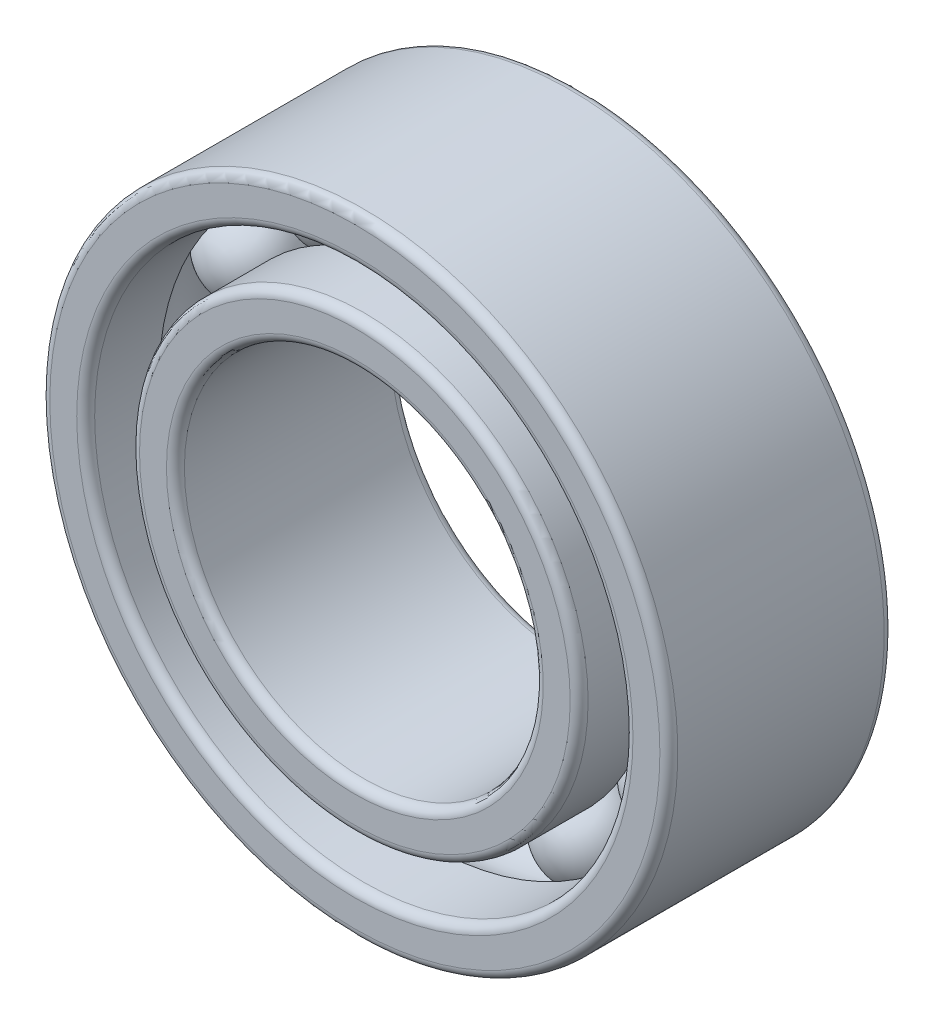
ISO-10303-21;
HEADER;
FILE_DESCRIPTION(('STEP AP214'),'2;1');
FILE_NAME('part.step','',(''),(''),'','','');
FILE_SCHEMA(('AUTOMOTIVE_DESIGN { 1 0 10303 214 1 1 1 1 }'));
ENDSEC;
DATA;
#1=APPLICATION_CONTEXT('core data for automotive mechanical design processes');
#2=APPLICATION_PROTOCOL_DEFINITION('international standard','automotive_design',2000,#1);
#3=PRODUCT_CONTEXT('',#1,'mechanical');
#4=PRODUCT('Part','Part','',(#3));
#5=PRODUCT_RELATED_PRODUCT_CATEGORY('part','',(#4));
#6=PRODUCT_DEFINITION_FORMATION('','',#4);
#7=PRODUCT_DEFINITION_CONTEXT('part definition',#1,'design');
#8=PRODUCT_DEFINITION('design','',#6,#7);
#9=PRODUCT_DEFINITION_SHAPE('','',#8);
#10=(LENGTH_UNIT() NAMED_UNIT(*) SI_UNIT(.MILLI.,.METRE.));
#11=(NAMED_UNIT(*) PLANE_ANGLE_UNIT() SI_UNIT($,.RADIAN.));
#12=(NAMED_UNIT(*) SI_UNIT($,.STERADIAN.) SOLID_ANGLE_UNIT());
#13=UNCERTAINTY_MEASURE_WITH_UNIT(LENGTH_MEASURE(1.E-05),#10,'distance_accuracy_value','');
#14=(GEOMETRIC_REPRESENTATION_CONTEXT(3) GLOBAL_UNCERTAINTY_ASSIGNED_CONTEXT((#13)) GLOBAL_UNIT_ASSIGNED_CONTEXT((#10,
#11,#12)) REPRESENTATION_CONTEXT('',''));
#15=CARTESIAN_POINT('',(0.,0.,0.));
#16=DIRECTION('',(0.,0.,1.));
#17=DIRECTION('',(1.,0.,0.));
#18=AXIS2_PLACEMENT_3D('',#15,#16,#17);
#19=CARTESIAN_POINT('',(1.37499999999997,2.38156986040722,0.));
#20=DIRECTION('',(0.,0.,1.));
#21=DIRECTION('',(0.499999999999989,0.866025403784445,0.));
#22=AXIS2_PLACEMENT_3D('',#19,#20,#21);
#23=SPHERICAL_SURFACE('',#22,0.5);
#24=CARTESIAN_POINT('',(1.37499999999997,2.38156986040722,0.5));
#25=VERTEX_POINT('',#24);
#26=VERTEX_LOOP('',#25);
#27=FACE_BOUND('',#26,.T.);
#28=ADVANCED_FACE('F38',(#27),#23,.T.);
#29=CLOSED_SHELL('',(#28));
#30=MANIFOLD_SOLID_BREP('B2',#29);
#31=CARTESIAN_POINT('',(2.38156986040719,1.37500000000003,0.));
#32=DIRECTION('',(0.,0.,1.));
#33=DIRECTION('',(0.866025403784433,0.50000000000001,0.));
#34=AXIS2_PLACEMENT_3D('',#31,#32,#33);
#35=SPHERICAL_SURFACE('',#34,0.5);
#36=CARTESIAN_POINT('',(2.38156986040719,1.37500000000003,0.5));
#37=VERTEX_POINT('',#36);
#38=VERTEX_LOOP('',#37);
#39=FACE_BOUND('',#38,.T.);
#40=ADVANCED_FACE('F57',(#39),#35,.T.);
#41=CLOSED_SHELL('',(#40));
#42=MANIFOLD_SOLID_BREP('B6',#41);
#43=CARTESIAN_POINT('',(2.75,0.,0.));
#44=DIRECTION('',(0.,0.,1.));
#45=DIRECTION('',(1.,0.,0.));
#46=AXIS2_PLACEMENT_3D('',#43,#44,#45);
#47=SPHERICAL_SURFACE('',#46,0.5);
#48=CARTESIAN_POINT('',(2.75,0.,0.5));
#49=VERTEX_POINT('',#48);
#50=VERTEX_LOOP('',#49);
#51=FACE_BOUND('',#50,.T.);
#52=ADVANCED_FACE('F76',(#51),#47,.T.);
#53=CLOSED_SHELL('',(#52));
#54=MANIFOLD_SOLID_BREP('B34',#53);
#55=CARTESIAN_POINT('',(2.38156986040722,-1.37499999999998,0.));
#56=DIRECTION('',(0.,0.,1.));
#57=DIRECTION('',(0.866025403784443,-0.499999999999992,0.));
#58=AXIS2_PLACEMENT_3D('',#55,#56,#57);
#59=SPHERICAL_SURFACE('',#58,0.5);
#60=CARTESIAN_POINT('',(2.38156986040722,-1.37499999999998,0.5));
#61=VERTEX_POINT('',#60);
#62=VERTEX_LOOP('',#61);
#63=FACE_BOUND('',#62,.T.);
#64=ADVANCED_FACE('F95',(#63),#59,.T.);
#65=CLOSED_SHELL('',(#64));
#66=MANIFOLD_SOLID_BREP('B53',#65);
#67=CARTESIAN_POINT('',(1.37500000000002,-2.38156986040719,0.));
#68=DIRECTION('',(0.,0.,1.));
#69=DIRECTION('',(0.500000000000007,-0.866025403784435,0.));
#70=AXIS2_PLACEMENT_3D('',#67,#68,#69);
#71=SPHERICAL_SURFACE('',#70,0.5);
#72=CARTESIAN_POINT('',(1.37500000000002,-2.38156986040719,0.5));
#73=VERTEX_POINT('',#72);
#74=VERTEX_LOOP('',#73);
#75=FACE_BOUND('',#74,.T.);
#76=ADVANCED_FACE('F114',(#75),#71,.T.);
#77=CLOSED_SHELL('',(#76));
#78=MANIFOLD_SOLID_BREP('B72',#77);
#79=CARTESIAN_POINT('',(0.,-2.75,0.));
#80=DIRECTION('',(0.,0.,1.));
#81=DIRECTION('',(0.,-1.,0.));
#82=AXIS2_PLACEMENT_3D('',#79,#80,#81);
#83=SPHERICAL_SURFACE('',#82,0.5);
#84=CARTESIAN_POINT('',(0.,-2.75,0.5));
#85=VERTEX_POINT('',#84);
#86=VERTEX_LOOP('',#85);
#87=FACE_BOUND('',#86,.T.);
#88=ADVANCED_FACE('F133',(#87),#83,.T.);
#89=CLOSED_SHELL('',(#88));
#90=MANIFOLD_SOLID_BREP('B91',#89);
#91=CARTESIAN_POINT('',(-1.37499999999999,-2.38156986040721,0.));
#92=DIRECTION('',(0.,0.,1.));
#93=DIRECTION('',(-0.499999999999995,-0.866025403784442,0.));
#94=AXIS2_PLACEMENT_3D('',#91,#92,#93);
#95=SPHERICAL_SURFACE('',#94,0.5);
#96=CARTESIAN_POINT('',(-1.37499999999999,-2.38156986040721,0.5));
#97=VERTEX_POINT('',#96);
#98=VERTEX_LOOP('',#97);
#99=FACE_BOUND('',#98,.T.);
#100=ADVANCED_FACE('F152',(#99),#95,.T.);
#101=CLOSED_SHELL('',(#100));
#102=MANIFOLD_SOLID_BREP('B110',#101);
#103=CARTESIAN_POINT('',(-2.3815698604072,-1.37500000000001,0.));
#104=DIRECTION('',(0.,0.,1.));
#105=DIRECTION('',(-0.866025403784436,-0.500000000000004,0.));
#106=AXIS2_PLACEMENT_3D('',#103,#104,#105);
#107=SPHERICAL_SURFACE('',#106,0.5);
#108=CARTESIAN_POINT('',(-2.3815698604072,-1.37500000000001,0.5));
#109=VERTEX_POINT('',#108);
#110=VERTEX_LOOP('',#109);
#111=FACE_BOUND('',#110,.T.);
#112=ADVANCED_FACE('F171',(#111),#107,.T.);
#113=CLOSED_SHELL('',(#112));
#114=MANIFOLD_SOLID_BREP('B129',#113);
#115=CARTESIAN_POINT('',(-2.75,0.,0.));
#116=DIRECTION('',(0.,0.,1.));
#117=DIRECTION('',(-1.,0.,0.));
#118=AXIS2_PLACEMENT_3D('',#115,#116,#117);
#119=SPHERICAL_SURFACE('',#118,0.5);
#120=CARTESIAN_POINT('',(-2.75,0.,0.5));
#121=VERTEX_POINT('',#120);
#122=VERTEX_LOOP('',#121);
#123=FACE_BOUND('',#122,.T.);
#124=ADVANCED_FACE('F190',(#123),#119,.T.);
#125=CLOSED_SHELL('',(#124));
#126=MANIFOLD_SOLID_BREP('B148',#125);
#127=CARTESIAN_POINT('',(-2.38156986040721,1.37499999999999,0.));
#128=DIRECTION('',(0.,0.,1.));
#129=DIRECTION('',(-0.86602540378444,0.499999999999998,0.));
#130=AXIS2_PLACEMENT_3D('',#127,#128,#129);
#131=SPHERICAL_SURFACE('',#130,0.5);
#132=CARTESIAN_POINT('',(-2.38156986040721,1.37499999999999,0.5));
#133=VERTEX_POINT('',#132);
#134=VERTEX_LOOP('',#133);
#135=FACE_BOUND('',#134,.T.);
#136=ADVANCED_FACE('F209',(#135),#131,.T.);
#137=CLOSED_SHELL('',(#136));
#138=MANIFOLD_SOLID_BREP('B167',#137);
#139=CARTESIAN_POINT('',(-1.375,2.3815698604072,0.));
#140=DIRECTION('',(0.,0.,1.));
#141=DIRECTION('',(-0.500000000000001,0.866025403784438,0.));
#142=AXIS2_PLACEMENT_3D('',#139,#140,#141);
#143=SPHERICAL_SURFACE('',#142,0.5);
#144=CARTESIAN_POINT('',(-1.375,2.3815698604072,0.5));
#145=VERTEX_POINT('',#144);
#146=VERTEX_LOOP('',#145);
#147=FACE_BOUND('',#146,.T.);
#148=ADVANCED_FACE('F228',(#147),#143,.T.);
#149=CLOSED_SHELL('',(#148));
#150=MANIFOLD_SOLID_BREP('B186',#149);
#151=CARTESIAN_POINT('',(0.,2.75,0.));
#152=DIRECTION('',(0.,0.,1.));
#153=DIRECTION('',(0.,1.,0.));
#154=AXIS2_PLACEMENT_3D('',#151,#152,#153);
#155=SPHERICAL_SURFACE('',#154,0.5);
#156=CARTESIAN_POINT('',(0.,2.75,0.5));
#157=VERTEX_POINT('',#156);
#158=VERTEX_LOOP('',#157);
#159=FACE_BOUND('',#158,.T.);
#160=ADVANCED_FACE('F249',(#159),#155,.T.);
#161=CLOSED_SHELL('',(#160));
#162=MANIFOLD_SOLID_BREP('B205',#161);
#163=CARTESIAN_POINT('',(0.,0.,0.));
#164=DIRECTION('',(0.,0.,1.));
#165=DIRECTION('',(1.,0.,0.));
#166=AXIS2_PLACEMENT_3D('',#163,#164,#165);
#167=TOROIDAL_SURFACE('',#166,2.75,0.5);
#168=CARTESIAN_POINT('',(0.,0.,-0.433012701892219));
#169=DIRECTION('',(0.,0.,1.));
#170=DIRECTION('',(1.,0.,0.));
#171=AXIS2_PLACEMENT_3D('',#168,#169,#170);
#172=CIRCLE('',#171,2.5);
#173=CARTESIAN_POINT('',(2.5,0.,-0.433012701892219));
#174=VERTEX_POINT('',#173);
#175=EDGE_CURVE('E304',#174,#174,#172,.T.);
#176=ORIENTED_EDGE('',*,*,#175,.T.);
#177=EDGE_LOOP('',(#176));
#178=FACE_BOUND('',#177,.T.);
#179=CARTESIAN_POINT('',(0.,0.,0.433012701892219));
#180=DIRECTION('',(0.,0.,1.));
#181=DIRECTION('',(1.,0.,0.));
#182=AXIS2_PLACEMENT_3D('',#179,#180,#181);
#183=CIRCLE('',#182,2.5);
#184=CARTESIAN_POINT('',(2.5,0.,0.433012701892219));
#185=VERTEX_POINT('',#184);
#186=EDGE_CURVE('E301',#185,#185,#183,.T.);
#187=ORIENTED_EDGE('',*,*,#186,.F.);
#188=EDGE_LOOP('',(#187));
#189=FACE_BOUND('',#188,.T.);
#190=ADVANCED_FACE('F269',(#178,#189),#167,.F.);
#191=CARTESIAN_POINT('',(0.,0.,0.));
#192=DIRECTION('',(0.,0.,1.));
#193=DIRECTION('',(1.,0.,0.));
#194=AXIS2_PLACEMENT_3D('',#191,#192,#193);
#195=CYLINDRICAL_SURFACE('',#194,2.5);
#196=CARTESIAN_POINT('',(0.,0.,1.15));
#197=DIRECTION('',(0.,0.,-1.));
#198=DIRECTION('',(-1.,0.,0.));
#199=AXIS2_PLACEMENT_3D('',#196,#197,#198);
#200=CIRCLE('',#199,2.5);
#201=CARTESIAN_POINT('',(-2.5,0.,1.15));
#202=VERTEX_POINT('',#201);
#203=EDGE_CURVE('E248',#202,#202,#200,.T.);
#204=ORIENTED_EDGE('',*,*,#203,.T.);
#205=EDGE_LOOP('',(#204));
#206=FACE_BOUND('',#205,.T.);
#207=ORIENTED_EDGE('',*,*,#186,.T.);
#208=EDGE_LOOP('',(#207));
#209=FACE_BOUND('',#208,.T.);
#210=ADVANCED_FACE('F327',(#206,#209),#195,.T.);
#211=CARTESIAN_POINT('',(0.,0.,1.25));
#212=DIRECTION('',(0.,0.,-1.));
#213=DIRECTION('',(-1.,0.,0.));
#214=AXIS2_PLACEMENT_3D('',#211,#212,#213);
#215=PLANE('',#214);
#216=CARTESIAN_POINT('',(0.,0.,1.25));
#217=DIRECTION('',(0.,0.,-1.));
#218=DIRECTION('',(-1.,0.,0.));
#219=AXIS2_PLACEMENT_3D('',#216,#217,#218);
#220=CIRCLE('',#219,2.4);
#221=CARTESIAN_POINT('',(-2.4,0.,1.25));
#222=VERTEX_POINT('',#221);
#223=EDGE_CURVE('E276',#222,#222,#220,.F.);
#224=ORIENTED_EDGE('',*,*,#223,.T.);
#225=EDGE_LOOP('',(#224));
#226=FACE_BOUND('',#225,.T.);
#227=CARTESIAN_POINT('',(0.,0.,1.25));
#228=DIRECTION('',(0.,0.,-1.));
#229=DIRECTION('',(-1.,0.,0.));
#230=AXIS2_PLACEMENT_3D('',#227,#228,#229);
#231=CIRCLE('',#230,2.1);
#232=CARTESIAN_POINT('',(-2.1,0.,1.25));
#233=VERTEX_POINT('',#232);
#234=EDGE_CURVE('E280',#233,#233,#231,.T.);
#235=ORIENTED_EDGE('',*,*,#234,.T.);
#236=EDGE_LOOP('',(#235));
#237=FACE_BOUND('',#236,.T.);
#238=ADVANCED_FACE('F332',(#226,#237),#215,.F.);
#239=CARTESIAN_POINT('',(0.,0.,0.));
#240=DIRECTION('',(0.,0.,1.));
#241=DIRECTION('',(1.,0.,0.));
#242=AXIS2_PLACEMENT_3D('',#239,#240,#241);
#243=CYLINDRICAL_SURFACE('',#242,2.);
#244=CARTESIAN_POINT('',(0.,0.,-1.15));
#245=DIRECTION('',(0.,0.,-1.));
#246=DIRECTION('',(-1.,0.,0.));
#247=AXIS2_PLACEMENT_3D('',#244,#245,#246);
#248=CIRCLE('',#247,2.);
#249=CARTESIAN_POINT('',(-2.,0.,-1.15));
#250=VERTEX_POINT('',#249);
#251=EDGE_CURVE('E284',#250,#250,#248,.T.);
#252=ORIENTED_EDGE('',*,*,#251,.T.);
#253=EDGE_LOOP('',(#252));
#254=FACE_BOUND('',#253,.T.);
#255=CARTESIAN_POINT('',(0.,0.,1.15));
#256=DIRECTION('',(0.,0.,-1.));
#257=DIRECTION('',(-1.,0.,0.));
#258=AXIS2_PLACEMENT_3D('',#255,#256,#257);
#259=CIRCLE('',#258,2.);
#260=CARTESIAN_POINT('',(-2.,0.,1.15));
#261=VERTEX_POINT('',#260);
#262=EDGE_CURVE('E289',#261,#261,#259,.F.);
#263=ORIENTED_EDGE('',*,*,#262,.T.);
#264=EDGE_LOOP('',(#263));
#265=FACE_BOUND('',#264,.T.);
#266=ADVANCED_FACE('F323',(#254,#265),#243,.F.);
#267=CARTESIAN_POINT('',(0.,0.,-1.25));
#268=DIRECTION('',(0.,0.,-1.));
#269=DIRECTION('',(-1.,0.,0.));
#270=AXIS2_PLACEMENT_3D('',#267,#268,#269);
#271=PLANE('',#270);
#272=CARTESIAN_POINT('',(0.,0.,-1.25));
#273=DIRECTION('',(0.,0.,-1.));
#274=DIRECTION('',(-1.,0.,0.));
#275=AXIS2_PLACEMENT_3D('',#272,#273,#274);
#276=CIRCLE('',#275,2.4);
#277=CARTESIAN_POINT('',(-2.4,0.,-1.25));
#278=VERTEX_POINT('',#277);
#279=EDGE_CURVE('E292',#278,#278,#276,.T.);
#280=ORIENTED_EDGE('',*,*,#279,.T.);
#281=EDGE_LOOP('',(#280));
#282=FACE_BOUND('',#281,.T.);
#283=CARTESIAN_POINT('',(0.,0.,-1.25));
#284=DIRECTION('',(0.,0.,-1.));
#285=DIRECTION('',(-1.,0.,0.));
#286=AXIS2_PLACEMENT_3D('',#283,#284,#285);
#287=CIRCLE('',#286,2.1);
#288=CARTESIAN_POINT('',(-2.1,0.,-1.25));
#289=VERTEX_POINT('',#288);
#290=EDGE_CURVE('E295',#289,#289,#287,.F.);
#291=ORIENTED_EDGE('',*,*,#290,.T.);
#292=EDGE_LOOP('',(#291));
#293=FACE_BOUND('',#292,.T.);
#294=ADVANCED_FACE('F313',(#282,#293),#271,.T.);
#295=CARTESIAN_POINT('',(0.,0.,0.));
#296=DIRECTION('',(0.,0.,1.));
#297=DIRECTION('',(1.,0.,0.));
#298=AXIS2_PLACEMENT_3D('',#295,#296,#297);
#299=CYLINDRICAL_SURFACE('',#298,2.5);
#300=CARTESIAN_POINT('',(0.,0.,-1.15));
#301=DIRECTION('',(0.,0.,-1.));
#302=DIRECTION('',(-1.,0.,0.));
#303=AXIS2_PLACEMENT_3D('',#300,#301,#302);
#304=CIRCLE('',#303,2.5);
#305=CARTESIAN_POINT('',(-2.5,0.,-1.15));
#306=VERTEX_POINT('',#305);
#307=EDGE_CURVE('E298',#306,#306,#304,.F.);
#308=ORIENTED_EDGE('',*,*,#307,.T.);
#309=EDGE_LOOP('',(#308));
#310=FACE_BOUND('',#309,.T.);
#311=ORIENTED_EDGE('',*,*,#175,.F.);
#312=EDGE_LOOP('',(#311));
#313=FACE_BOUND('',#312,.T.);
#314=ADVANCED_FACE('F310',(#310,#313),#299,.T.);
#315=CARTESIAN_POINT('',(0.,0.,-1.15));
#316=DIRECTION('',(0.,0.,-1.));
#317=DIRECTION('',(-1.,0.,0.));
#318=AXIS2_PLACEMENT_3D('',#315,#316,#317);
#319=TOROIDAL_SURFACE('',#318,2.4,0.1);
#320=ORIENTED_EDGE('',*,*,#279,.F.);
#321=EDGE_LOOP('',(#320));
#322=FACE_BOUND('',#321,.T.);
#323=ORIENTED_EDGE('',*,*,#307,.F.);
#324=EDGE_LOOP('',(#323));
#325=FACE_BOUND('',#324,.T.);
#326=ADVANCED_FACE('F312',(#322,#325),#319,.T.);
#327=CARTESIAN_POINT('',(0.,0.,-1.15));
#328=DIRECTION('',(0.,0.,-1.));
#329=DIRECTION('',(-1.,0.,0.));
#330=AXIS2_PLACEMENT_3D('',#327,#328,#329);
#331=TOROIDAL_SURFACE('',#330,2.1,0.1);
#332=ORIENTED_EDGE('',*,*,#251,.F.);
#333=EDGE_LOOP('',(#332));
#334=FACE_BOUND('',#333,.T.);
#335=ORIENTED_EDGE('',*,*,#290,.F.);
#336=EDGE_LOOP('',(#335));
#337=FACE_BOUND('',#336,.T.);
#338=ADVANCED_FACE('F320',(#334,#337),#331,.T.);
#339=CARTESIAN_POINT('',(0.,0.,1.15));
#340=DIRECTION('',(0.,0.,-1.));
#341=DIRECTION('',(-1.,0.,0.));
#342=AXIS2_PLACEMENT_3D('',#339,#340,#341);
#343=TOROIDAL_SURFACE('',#342,2.4,0.1);
#344=ORIENTED_EDGE('',*,*,#203,.F.);
#345=EDGE_LOOP('',(#344));
#346=FACE_BOUND('',#345,.T.);
#347=ORIENTED_EDGE('',*,*,#223,.F.);
#348=EDGE_LOOP('',(#347));
#349=FACE_BOUND('',#348,.T.);
#350=ADVANCED_FACE('F337',(#346,#349),#343,.T.);
#351=CARTESIAN_POINT('',(0.,0.,1.15));
#352=DIRECTION('',(0.,0.,-1.));
#353=DIRECTION('',(-1.,0.,0.));
#354=AXIS2_PLACEMENT_3D('',#351,#352,#353);
#355=TOROIDAL_SURFACE('',#354,2.1,0.1);
#356=ORIENTED_EDGE('',*,*,#234,.F.);
#357=EDGE_LOOP('',(#356));
#358=FACE_BOUND('',#357,.T.);
#359=ORIENTED_EDGE('',*,*,#262,.F.);
#360=EDGE_LOOP('',(#359));
#361=FACE_BOUND('',#360,.T.);
#362=ADVANCED_FACE('F271',(#358,#361),#355,.T.);
#363=CLOSED_SHELL('',(#190,#210,#238,#266,#294,#314,#326,#338,#350,#362));
#364=MANIFOLD_SOLID_BREP('B224',#363);
#365=CARTESIAN_POINT('',(0.,0.,0.));
#366=DIRECTION('',(0.,0.,1.));
#367=DIRECTION('',(1.,0.,0.));
#368=AXIS2_PLACEMENT_3D('',#365,#366,#367);
#369=TOROIDAL_SURFACE('',#368,2.75,0.5);
#370=CARTESIAN_POINT('',(0.,0.,0.433012701892219));
#371=DIRECTION('',(0.,0.,1.));
#372=DIRECTION('',(1.,0.,0.));
#373=AXIS2_PLACEMENT_3D('',#370,#371,#372);
#374=CIRCLE('',#373,3.);
#375=CARTESIAN_POINT('',(3.,0.,0.433012701892219));
#376=VERTEX_POINT('',#375);
#377=EDGE_CURVE('E456',#376,#376,#374,.T.);
#378=ORIENTED_EDGE('',*,*,#377,.T.);
#379=EDGE_LOOP('',(#378));
#380=FACE_BOUND('',#379,.T.);
#381=CARTESIAN_POINT('',(0.,0.,-0.433012701892219));
#382=DIRECTION('',(0.,0.,1.));
#383=DIRECTION('',(1.,0.,0.));
#384=AXIS2_PLACEMENT_3D('',#381,#382,#383);
#385=CIRCLE('',#384,3.);
#386=CARTESIAN_POINT('',(3.,0.,-0.433012701892219));
#387=VERTEX_POINT('',#386);
#388=EDGE_CURVE('E453',#387,#387,#385,.T.);
#389=ORIENTED_EDGE('',*,*,#388,.F.);
#390=EDGE_LOOP('',(#389));
#391=FACE_BOUND('',#390,.T.);
#392=ADVANCED_FACE('F421',(#380,#391),#369,.F.);
#393=CARTESIAN_POINT('',(0.,0.,0.));
#394=DIRECTION('',(0.,0.,1.));
#395=DIRECTION('',(1.,0.,0.));
#396=AXIS2_PLACEMENT_3D('',#393,#394,#395);
#397=CYLINDRICAL_SURFACE('',#396,3.);
#398=CARTESIAN_POINT('',(0.,0.,-1.15));
#399=DIRECTION('',(0.,0.,-1.));
#400=DIRECTION('',(-1.,0.,0.));
#401=AXIS2_PLACEMENT_3D('',#398,#399,#400);
#402=CIRCLE('',#401,3.);
#403=CARTESIAN_POINT('',(-3.,0.,-1.15));
#404=VERTEX_POINT('',#403);
#405=EDGE_CURVE('E444',#404,#404,#402,.T.);
#406=ORIENTED_EDGE('',*,*,#405,.T.);
#407=EDGE_LOOP('',(#406));
#408=FACE_BOUND('',#407,.T.);
#409=ORIENTED_EDGE('',*,*,#388,.T.);
#410=EDGE_LOOP('',(#409));
#411=FACE_BOUND('',#410,.T.);
#412=ADVANCED_FACE('F479',(#408,#411),#397,.F.);
#413=CARTESIAN_POINT('',(0.,0.,-1.25));
#414=DIRECTION('',(0.,0.,-1.));
#415=DIRECTION('',(-1.,0.,0.));
#416=AXIS2_PLACEMENT_3D('',#413,#414,#415);
#417=PLANE('',#416);
#418=CARTESIAN_POINT('',(0.,0.,-1.25));
#419=DIRECTION('',(0.,0.,-1.));
#420=DIRECTION('',(-1.,0.,0.));
#421=AXIS2_PLACEMENT_3D('',#418,#419,#420);
#422=CIRCLE('',#421,3.1);
#423=CARTESIAN_POINT('',(-3.1,0.,-1.25));
#424=VERTEX_POINT('',#423);
#425=EDGE_CURVE('E447',#424,#424,#422,.F.);
#426=ORIENTED_EDGE('',*,*,#425,.T.);
#427=EDGE_LOOP('',(#426));
#428=FACE_BOUND('',#427,.T.);
#429=CARTESIAN_POINT('',(0.,0.,-1.25));
#430=DIRECTION('',(0.,0.,-1.));
#431=DIRECTION('',(-1.,0.,0.));
#432=AXIS2_PLACEMENT_3D('',#429,#430,#431);
#433=CIRCLE('',#432,3.4);
#434=CARTESIAN_POINT('',(-3.4,0.,-1.25));
#435=VERTEX_POINT('',#434);
#436=EDGE_CURVE('E450',#435,#435,#433,.T.);
#437=ORIENTED_EDGE('',*,*,#436,.T.);
#438=EDGE_LOOP('',(#437));
#439=FACE_BOUND('',#438,.T.);
#440=ADVANCED_FACE('F484',(#428,#439),#417,.T.);
#441=CARTESIAN_POINT('',(0.,0.,0.));
#442=DIRECTION('',(0.,0.,1.));
#443=DIRECTION('',(1.,0.,0.));
#444=AXIS2_PLACEMENT_3D('',#441,#442,#443);
#445=CYLINDRICAL_SURFACE('',#444,3.5);
#446=CARTESIAN_POINT('',(0.,0.,-1.15));
#447=DIRECTION('',(0.,0.,-1.));
#448=DIRECTION('',(-1.,0.,0.));
#449=AXIS2_PLACEMENT_3D('',#446,#447,#448);
#450=CIRCLE('',#449,3.5);
#451=CARTESIAN_POINT('',(-3.5,0.,-1.15));
#452=VERTEX_POINT('',#451);
#453=EDGE_CURVE('E268',#452,#452,#450,.F.);
#454=ORIENTED_EDGE('',*,*,#453,.T.);
#455=EDGE_LOOP('',(#454));
#456=FACE_BOUND('',#455,.T.);
#457=CARTESIAN_POINT('',(0.,0.,1.15));
#458=DIRECTION('',(0.,0.,-1.));
#459=DIRECTION('',(-1.,0.,0.));
#460=AXIS2_PLACEMENT_3D('',#457,#458,#459);
#461=CIRCLE('',#460,3.5);
#462=CARTESIAN_POINT('',(-3.5,0.,1.15));
#463=VERTEX_POINT('',#462);
#464=EDGE_CURVE('E428',#463,#463,#461,.T.);
#465=ORIENTED_EDGE('',*,*,#464,.T.);
#466=EDGE_LOOP('',(#465));
#467=FACE_BOUND('',#466,.T.);
#468=ADVANCED_FACE('F475',(#456,#467),#445,.T.);
#469=CARTESIAN_POINT('',(0.,0.,1.25));
#470=DIRECTION('',(0.,0.,-1.));
#471=DIRECTION('',(-1.,0.,0.));
#472=AXIS2_PLACEMENT_3D('',#469,#470,#471);
#473=PLANE('',#472);
#474=CARTESIAN_POINT('',(0.,0.,1.25));
#475=DIRECTION('',(0.,0.,-1.));
#476=DIRECTION('',(-1.,0.,0.));
#477=AXIS2_PLACEMENT_3D('',#474,#475,#476);
#478=CIRCLE('',#477,3.1);
#479=CARTESIAN_POINT('',(-3.1,0.,1.25));
#480=VERTEX_POINT('',#479);
#481=EDGE_CURVE('E432',#480,#480,#478,.T.);
#482=ORIENTED_EDGE('',*,*,#481,.T.);
#483=EDGE_LOOP('',(#482));
#484=FACE_BOUND('',#483,.T.);
#485=CARTESIAN_POINT('',(0.,0.,1.25));
#486=DIRECTION('',(0.,0.,-1.));
#487=DIRECTION('',(-1.,0.,0.));
#488=AXIS2_PLACEMENT_3D('',#485,#486,#487);
#489=CIRCLE('',#488,3.4);
#490=CARTESIAN_POINT('',(-3.4,0.,1.25));
#491=VERTEX_POINT('',#490);
#492=EDGE_CURVE('E436',#491,#491,#489,.F.);
#493=ORIENTED_EDGE('',*,*,#492,.T.);
#494=EDGE_LOOP('',(#493));
#495=FACE_BOUND('',#494,.T.);
#496=ADVANCED_FACE('F465',(#484,#495),#473,.F.);
#497=CARTESIAN_POINT('',(0.,0.,0.));
#498=DIRECTION('',(0.,0.,1.));
#499=DIRECTION('',(1.,0.,0.));
#500=AXIS2_PLACEMENT_3D('',#497,#498,#499);
#501=CYLINDRICAL_SURFACE('',#500,3.);
#502=CARTESIAN_POINT('',(0.,0.,1.15));
#503=DIRECTION('',(0.,0.,-1.));
#504=DIRECTION('',(-1.,0.,0.));
#505=AXIS2_PLACEMENT_3D('',#502,#503,#504);
#506=CIRCLE('',#505,3.);
#507=CARTESIAN_POINT('',(-3.,0.,1.15));
#508=VERTEX_POINT('',#507);
#509=EDGE_CURVE('E441',#508,#508,#506,.F.);
#510=ORIENTED_EDGE('',*,*,#509,.T.);
#511=EDGE_LOOP('',(#510));
#512=FACE_BOUND('',#511,.T.);
#513=ORIENTED_EDGE('',*,*,#377,.F.);
#514=EDGE_LOOP('',(#513));
#515=FACE_BOUND('',#514,.T.);
#516=ADVANCED_FACE('F462',(#512,#515),#501,.F.);
#517=CARTESIAN_POINT('',(0.,0.,-1.15));
#518=DIRECTION('',(0.,0.,-1.));
#519=DIRECTION('',(-1.,0.,0.));
#520=AXIS2_PLACEMENT_3D('',#517,#518,#519);
#521=TOROIDAL_SURFACE('',#520,3.1,0.1);
#522=ORIENTED_EDGE('',*,*,#405,.F.);
#523=EDGE_LOOP('',(#522));
#524=FACE_BOUND('',#523,.T.);
#525=ORIENTED_EDGE('',*,*,#425,.F.);
#526=EDGE_LOOP('',(#525));
#527=FACE_BOUND('',#526,.T.);
#528=ADVANCED_FACE('F464',(#524,#527),#521,.T.);
#529=CARTESIAN_POINT('',(0.,0.,1.15));
#530=DIRECTION('',(0.,0.,-1.));
#531=DIRECTION('',(-1.,0.,0.));
#532=AXIS2_PLACEMENT_3D('',#529,#530,#531);
#533=TOROIDAL_SURFACE('',#532,3.1,0.1);
#534=ORIENTED_EDGE('',*,*,#481,.F.);
#535=EDGE_LOOP('',(#534));
#536=FACE_BOUND('',#535,.T.);
#537=ORIENTED_EDGE('',*,*,#509,.F.);
#538=EDGE_LOOP('',(#537));
#539=FACE_BOUND('',#538,.T.);
#540=ADVANCED_FACE('F472',(#536,#539),#533,.T.);
#541=CARTESIAN_POINT('',(0.,0.,-1.15));
#542=DIRECTION('',(0.,0.,-1.));
#543=DIRECTION('',(-1.,0.,0.));
#544=AXIS2_PLACEMENT_3D('',#541,#542,#543);
#545=TOROIDAL_SURFACE('',#544,3.4,0.1);
#546=ORIENTED_EDGE('',*,*,#436,.F.);
#547=EDGE_LOOP('',(#546));
#548=FACE_BOUND('',#547,.T.);
#549=ORIENTED_EDGE('',*,*,#453,.F.);
#550=EDGE_LOOP('',(#549));
#551=FACE_BOUND('',#550,.T.);
#552=ADVANCED_FACE('F490',(#548,#551),#545,.T.);
#553=CARTESIAN_POINT('',(0.,0.,1.15));
#554=DIRECTION('',(0.,0.,-1.));
#555=DIRECTION('',(-1.,0.,0.));
#556=AXIS2_PLACEMENT_3D('',#553,#554,#555);
#557=TOROIDAL_SURFACE('',#556,3.4,0.1);
#558=ORIENTED_EDGE('',*,*,#464,.F.);
#559=EDGE_LOOP('',(#558));
#560=FACE_BOUND('',#559,.T.);
#561=ORIENTED_EDGE('',*,*,#492,.F.);
#562=EDGE_LOOP('',(#561));
#563=FACE_BOUND('',#562,.T.);
#564=ADVANCED_FACE('F423',(#560,#563),#557,.T.);
#565=CLOSED_SHELL('',(#392,#412,#440,#468,#496,#516,#528,#540,#552,#564));
#566=MANIFOLD_SOLID_BREP('B243',#565);
#567=ADVANCED_BREP_SHAPE_REPRESENTATION('',(#18,#30,#42,#54,#66,#78,#90,#102,#114,#126,#138,
#150,#162,#364,#566),#14);
#568=SHAPE_DEFINITION_REPRESENTATION(#9,#567);
ENDSEC;
END-ISO-10303-21;
